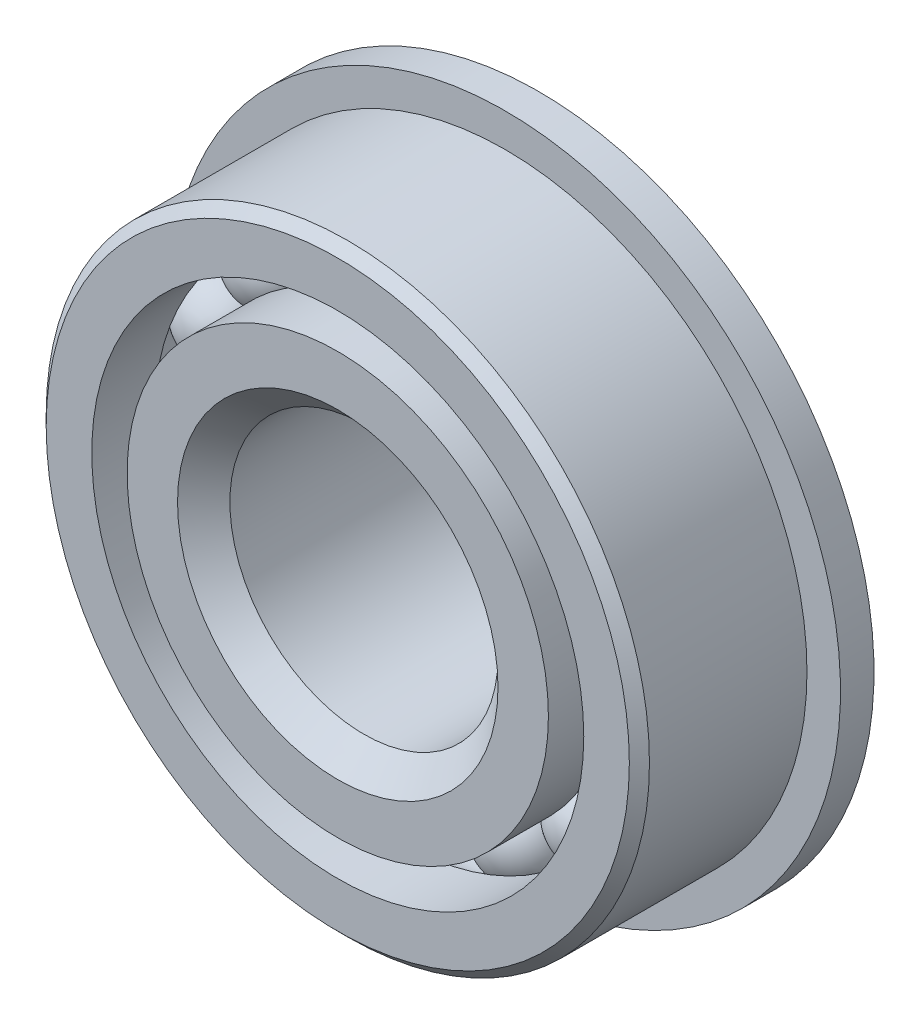
ISO-10303-21;
HEADER;
FILE_DESCRIPTION(('STEP AP214'),'2;1');
FILE_NAME('part.step','',(''),(''),'','','');
FILE_SCHEMA(('AUTOMOTIVE_DESIGN { 1 0 10303 214 1 1 1 1 }'));
ENDSEC;
DATA;
#1=APPLICATION_CONTEXT('core data for automotive mechanical design processes');
#2=APPLICATION_PROTOCOL_DEFINITION('international standard','automotive_design',2000,#1);
#3=PRODUCT_CONTEXT('',#1,'mechanical');
#4=PRODUCT('Part','Part','',(#3));
#5=PRODUCT_RELATED_PRODUCT_CATEGORY('part','',(#4));
#6=PRODUCT_DEFINITION_FORMATION('','',#4);
#7=PRODUCT_DEFINITION_CONTEXT('part definition',#1,'design');
#8=PRODUCT_DEFINITION('design','',#6,#7);
#9=PRODUCT_DEFINITION_SHAPE('','',#8);
#10=(LENGTH_UNIT() NAMED_UNIT(*) SI_UNIT(.MILLI.,.METRE.));
#11=(NAMED_UNIT(*) PLANE_ANGLE_UNIT() SI_UNIT($,.RADIAN.));
#12=(NAMED_UNIT(*) SI_UNIT($,.STERADIAN.) SOLID_ANGLE_UNIT());
#13=UNCERTAINTY_MEASURE_WITH_UNIT(LENGTH_MEASURE(1.E-05),#10,'distance_accuracy_value','');
#14=(GEOMETRIC_REPRESENTATION_CONTEXT(3) GLOBAL_UNCERTAINTY_ASSIGNED_CONTEXT((#13)) GLOBAL_UNIT_ASSIGNED_CONTEXT((#10,
#11,#12)) REPRESENTATION_CONTEXT('',''));
#15=CARTESIAN_POINT('',(0.,0.,0.));
#16=DIRECTION('',(0.,0.,1.));
#17=DIRECTION('',(1.,0.,0.));
#18=AXIS2_PLACEMENT_3D('',#15,#16,#17);
#19=CARTESIAN_POINT('',(-4.138661526742,9.99161278793267,0.));
#20=DIRECTION('',(0.,0.,1.));
#21=DIRECTION('',(-0.382683432365077,0.923879532511292,0.));
#22=AXIS2_PLACEMENT_3D('',#19,#20,#21);
#23=SPHERICAL_SURFACE('',#22,1.984375);
#24=CARTESIAN_POINT('',(-4.138661526742,9.99161278793267,1.984375));
#25=VERTEX_POINT('',#24);
#26=VERTEX_LOOP('',#25);
#27=FACE_BOUND('',#26,.T.);
#28=ADVANCED_FACE('F35',(#27),#23,.T.);
#29=CLOSED_SHELL('',(#28));
#30=MANIFOLD_SOLID_BREP('B2',#29);
#31=CARTESIAN_POINT('',(-7.64724935309786,7.64724935309804,0.));
#32=DIRECTION('',(0.,0.,1.));
#33=DIRECTION('',(-0.707106781186539,0.707106781186556,0.));
#34=AXIS2_PLACEMENT_3D('',#31,#32,#33);
#35=SPHERICAL_SURFACE('',#34,1.984375);
#36=CARTESIAN_POINT('',(-7.64724935309786,7.64724935309804,1.984375));
#37=VERTEX_POINT('',#36);
#38=VERTEX_LOOP('',#37);
#39=FACE_BOUND('',#38,.T.);
#40=ADVANCED_FACE('F53',(#39),#35,.T.);
#41=CLOSED_SHELL('',(#40));
#42=MANIFOLD_SOLID_BREP('B6',#41);
#43=CARTESIAN_POINT('',(-9.99161278793257,4.13866152674225,0.));
#44=DIRECTION('',(0.,0.,1.));
#45=DIRECTION('',(-0.923879532511283,0.3826834323651,0.));
#46=AXIS2_PLACEMENT_3D('',#43,#44,#45);
#47=SPHERICAL_SURFACE('',#46,1.984375);
#48=CARTESIAN_POINT('',(-9.99161278793257,4.13866152674225,1.984375));
#49=VERTEX_POINT('',#48);
#50=VERTEX_LOOP('',#49);
#51=FACE_BOUND('',#50,.T.);
#52=ADVANCED_FACE('F72',(#51),#47,.T.);
#53=CLOSED_SHELL('',(#52));
#54=MANIFOLD_SOLID_BREP('B31',#53);
#55=CARTESIAN_POINT('',(-10.81484375,1.13279541018368E-13,0.));
#56=DIRECTION('',(0.,0.,1.));
#57=DIRECTION('',(-1.,0.,0.));
#58=AXIS2_PLACEMENT_3D('',#55,#56,#57);
#59=SPHERICAL_SURFACE('',#58,1.984375);
#60=CARTESIAN_POINT('',(-10.81484375,1.13279541018368E-13,1.984375));
#61=VERTEX_POINT('',#60);
#62=VERTEX_LOOP('',#61);
#63=FACE_BOUND('',#62,.T.);
#64=ADVANCED_FACE('F93',(#63),#59,.T.);
#65=CLOSED_SHELL('',(#64));
#66=MANIFOLD_SOLID_BREP('B49',#65);
#67=CARTESIAN_POINT('',(-9.99161278793265,-4.13866152674204,0.));
#68=DIRECTION('',(0.,0.,1.));
#69=DIRECTION('',(-0.923879532511291,-0.382683432365081,0.));
#70=AXIS2_PLACEMENT_3D('',#67,#68,#69);
#71=SPHERICAL_SURFACE('',#70,1.984375);
#72=CARTESIAN_POINT('',(-9.99161278793265,-4.13866152674204,1.984375));
#73=VERTEX_POINT('',#72);
#74=VERTEX_LOOP('',#73);
#75=FACE_BOUND('',#74,.T.);
#76=ADVANCED_FACE('F111',(#75),#71,.T.);
#77=CLOSED_SHELL('',(#76));
#78=MANIFOLD_SOLID_BREP('B68',#77);
#79=CARTESIAN_POINT('',(-7.64724935309802,-7.64724935309789,0.));
#80=DIRECTION('',(0.,0.,1.));
#81=DIRECTION('',(-0.707106781186554,-0.707106781186541,0.));
#82=AXIS2_PLACEMENT_3D('',#79,#80,#81);
#83=SPHERICAL_SURFACE('',#82,1.984375);
#84=CARTESIAN_POINT('',(-7.64724935309802,-7.64724935309789,1.984375));
#85=VERTEX_POINT('',#84);
#86=VERTEX_LOOP('',#85);
#87=FACE_BOUND('',#86,.T.);
#88=ADVANCED_FACE('F129',(#87),#83,.T.);
#89=CLOSED_SHELL('',(#88));
#90=MANIFOLD_SOLID_BREP('B89',#89);
#91=CARTESIAN_POINT('',(-4.13866152674222,-9.99161278793258,0.));
#92=DIRECTION('',(0.,0.,1.));
#93=DIRECTION('',(-0.382683432365097,-0.923879532511284,0.));
#94=AXIS2_PLACEMENT_3D('',#91,#92,#93);
#95=SPHERICAL_SURFACE('',#94,1.984375);
#96=CARTESIAN_POINT('',(-4.13866152674222,-9.99161278793258,1.984375));
#97=VERTEX_POINT('',#96);
#98=VERTEX_LOOP('',#97);
#99=FACE_BOUND('',#98,.T.);
#100=ADVANCED_FACE('F147',(#99),#95,.T.);
#101=CLOSED_SHELL('',(#100));
#102=MANIFOLD_SOLID_BREP('B107',#101);
#103=CARTESIAN_POINT('',(0.,-10.81484375,0.));
#104=DIRECTION('',(0.,0.,1.));
#105=DIRECTION('',(0.,-1.,0.));
#106=AXIS2_PLACEMENT_3D('',#103,#104,#105);
#107=SPHERICAL_SURFACE('',#106,1.984375);
#108=CARTESIAN_POINT('',(0.,-10.81484375,1.984375));
#109=VERTEX_POINT('',#108);
#110=VERTEX_LOOP('',#109);
#111=FACE_BOUND('',#110,.T.);
#112=ADVANCED_FACE('F165',(#111),#107,.T.);
#113=CLOSED_SHELL('',(#112));
#114=MANIFOLD_SOLID_BREP('B125',#113);
#115=CARTESIAN_POINT('',(4.13866152674208,-9.99161278793264,0.));
#116=DIRECTION('',(0.,0.,1.));
#117=DIRECTION('',(0.382683432365084,-0.923879532511289,0.));
#118=AXIS2_PLACEMENT_3D('',#115,#116,#117);
#119=SPHERICAL_SURFACE('',#118,1.984375);
#120=CARTESIAN_POINT('',(4.13866152674208,-9.99161278793264,1.984375));
#121=VERTEX_POINT('',#120);
#122=VERTEX_LOOP('',#121);
#123=FACE_BOUND('',#122,.T.);
#124=ADVANCED_FACE('F183',(#123),#119,.T.);
#125=CLOSED_SHELL('',(#124));
#126=MANIFOLD_SOLID_BREP('B143',#125);
#127=CARTESIAN_POINT('',(7.64724935309791,-7.64724935309799,0.));
#128=DIRECTION('',(0.,0.,1.));
#129=DIRECTION('',(0.707106781186544,-0.707106781186551,0.));
#130=AXIS2_PLACEMENT_3D('',#127,#128,#129);
#131=SPHERICAL_SURFACE('',#130,1.984375);
#132=CARTESIAN_POINT('',(7.64724935309791,-7.64724935309799,1.984375));
#133=VERTEX_POINT('',#132);
#134=VERTEX_LOOP('',#133);
#135=FACE_BOUND('',#134,.T.);
#136=ADVANCED_FACE('F201',(#135),#131,.T.);
#137=CLOSED_SHELL('',(#136));
#138=MANIFOLD_SOLID_BREP('B161',#137);
#139=CARTESIAN_POINT('',(9.9916127879326,-4.13866152674218,0.));
#140=DIRECTION('',(0.,0.,1.));
#141=DIRECTION('',(0.923879532511285,-0.382683432365094,0.));
#142=AXIS2_PLACEMENT_3D('',#139,#140,#141);
#143=SPHERICAL_SURFACE('',#142,1.984375);
#144=CARTESIAN_POINT('',(9.9916127879326,-4.13866152674218,1.984375));
#145=VERTEX_POINT('',#144);
#146=VERTEX_LOOP('',#145);
#147=FACE_BOUND('',#146,.T.);
#148=ADVANCED_FACE('F219',(#147),#143,.T.);
#149=CLOSED_SHELL('',(#148));
#150=MANIFOLD_SOLID_BREP('B179',#149);
#151=CARTESIAN_POINT('',(10.81484375,0.,0.));
#152=DIRECTION('',(0.,0.,1.));
#153=DIRECTION('',(1.,0.,0.));
#154=AXIS2_PLACEMENT_3D('',#151,#152,#153);
#155=SPHERICAL_SURFACE('',#154,1.984375);
#156=CARTESIAN_POINT('',(10.81484375,0.,1.984375));
#157=VERTEX_POINT('',#156);
#158=VERTEX_LOOP('',#157);
#159=FACE_BOUND('',#158,.T.);
#160=ADVANCED_FACE('F238',(#159),#155,.T.);
#161=CLOSED_SHELL('',(#160));
#162=MANIFOLD_SOLID_BREP('B197',#161);
#163=CARTESIAN_POINT('',(9.99161278793262,4.13866152674211,0.));
#164=DIRECTION('',(0.,0.,1.));
#165=DIRECTION('',(0.923879532511288,0.382683432365087,0.));
#166=AXIS2_PLACEMENT_3D('',#163,#164,#165);
#167=SPHERICAL_SURFACE('',#166,1.984375);
#168=CARTESIAN_POINT('',(9.99161278793262,4.13866152674211,1.984375));
#169=VERTEX_POINT('',#168);
#170=VERTEX_LOOP('',#169);
#171=FACE_BOUND('',#170,.T.);
#172=ADVANCED_FACE('F259',(#171),#167,.T.);
#173=CLOSED_SHELL('',(#172));
#174=MANIFOLD_SOLID_BREP('B215',#173);
#175=CARTESIAN_POINT('',(7.64724935309796,7.64724935309794,0.));
#176=DIRECTION('',(0.,0.,1.));
#177=DIRECTION('',(0.707106781186549,0.707106781186546,0.));
#178=AXIS2_PLACEMENT_3D('',#175,#176,#177);
#179=SPHERICAL_SURFACE('',#178,1.984375);
#180=CARTESIAN_POINT('',(7.64724935309796,7.64724935309794,1.984375));
#181=VERTEX_POINT('',#180);
#182=VERTEX_LOOP('',#181);
#183=FACE_BOUND('',#182,.T.);
#184=ADVANCED_FACE('F277',(#183),#179,.T.);
#185=CLOSED_SHELL('',(#184));
#186=MANIFOLD_SOLID_BREP('B234',#185);
#187=CARTESIAN_POINT('',(4.13866152674215,9.99161278793261,0.));
#188=DIRECTION('',(0.,0.,1.));
#189=DIRECTION('',(0.382683432365091,0.923879532511287,0.));
#190=AXIS2_PLACEMENT_3D('',#187,#188,#189);
#191=SPHERICAL_SURFACE('',#190,1.984375);
#192=CARTESIAN_POINT('',(4.13866152674215,9.99161278793261,1.984375));
#193=VERTEX_POINT('',#192);
#194=VERTEX_LOOP('',#193);
#195=FACE_BOUND('',#194,.T.);
#196=ADVANCED_FACE('F295',(#195),#191,.T.);
#197=CLOSED_SHELL('',(#196));
#198=MANIFOLD_SOLID_BREP('B255',#197);
#199=CARTESIAN_POINT('',(0.,10.81484375,0.));
#200=DIRECTION('',(0.,0.,1.));
#201=DIRECTION('',(0.,1.,0.));
#202=AXIS2_PLACEMENT_3D('',#199,#200,#201);
#203=SPHERICAL_SURFACE('',#202,1.984375);
#204=CARTESIAN_POINT('',(0.,10.81484375,1.984375));
#205=VERTEX_POINT('',#204);
#206=VERTEX_LOOP('',#205);
#207=FACE_BOUND('',#206,.T.);
#208=ADVANCED_FACE('F316',(#207),#203,.T.);
#209=CLOSED_SHELL('',(#208));
#210=MANIFOLD_SOLID_BREP('B273',#209);
#211=CARTESIAN_POINT('',(0.,0.,4.7625));
#212=DIRECTION('',(0.,0.,1.));
#213=DIRECTION('',(1.,0.,0.));
#214=AXIS2_PLACEMENT_3D('',#211,#212,#213);
#215=CYLINDRICAL_SURFACE('',#214,9.97748111263737);
#216=CARTESIAN_POINT('',(0.,0.,-1.79904640133991));
#217=DIRECTION('',(0.,0.,1.));
#218=DIRECTION('',(1.,0.,0.));
#219=AXIS2_PLACEMENT_3D('',#216,#217,#218);
#220=CIRCLE('',#219,9.97748111263737);
#221=CARTESIAN_POINT('',(9.97748111263737,0.,-1.79904640133991));
#222=VERTEX_POINT('',#221);
#223=EDGE_CURVE('E350',#222,#222,#220,.T.);
#224=ORIENTED_EDGE('',*,*,#223,.F.);
#225=EDGE_LOOP('',(#224));
#226=FACE_BOUND('',#225,.T.);
#227=CARTESIAN_POINT('',(0.,0.,-6.35));
#228=DIRECTION('',(0.,0.,1.));
#229=DIRECTION('',(1.,0.,0.));
#230=AXIS2_PLACEMENT_3D('',#227,#228,#229);
#231=CIRCLE('',#230,9.97748111263737);
#232=CARTESIAN_POINT('',(9.97748111263737,0.,-6.35));
#233=VERTEX_POINT('',#232);
#234=EDGE_CURVE('E354',#233,#233,#231,.T.);
#235=ORIENTED_EDGE('',*,*,#234,.T.);
#236=EDGE_LOOP('',(#235));
#237=FACE_BOUND('',#236,.T.);
#238=ADVANCED_FACE('F339',(#226,#237),#215,.T.);
#239=CARTESIAN_POINT('',(0.,6.82625,-6.35));
#240=DIRECTION('',(0.,0.,1.));
#241=DIRECTION('',(1.,0.,0.));
#242=AXIS2_PLACEMENT_3D('',#239,#240,#241);
#243=PLANE('',#242);
#244=ORIENTED_EDGE('',*,*,#234,.F.);
#245=EDGE_LOOP('',(#244));
#246=FACE_BOUND('',#245,.T.);
#247=CARTESIAN_POINT('',(0.,0.,-6.35));
#248=DIRECTION('',(0.,0.,1.));
#249=DIRECTION('',(1.,0.,0.));
#250=AXIS2_PLACEMENT_3D('',#247,#248,#249);
#251=CIRCLE('',#250,6.82625);
#252=CARTESIAN_POINT('',(6.82625,0.,-6.35));
#253=VERTEX_POINT('',#252);
#254=EDGE_CURVE('E359',#253,#253,#251,.T.);
#255=ORIENTED_EDGE('',*,*,#254,.T.);
#256=EDGE_LOOP('',(#255));
#257=FACE_BOUND('',#256,.T.);
#258=ADVANCED_FACE('F386',(#246,#257),#243,.F.);
#259=CARTESIAN_POINT('',(0.,0.,-5.87375));
#260=DIRECTION('',(0.,0.,-1.));
#261=DIRECTION('',(-1.,0.,0.));
#262=AXIS2_PLACEMENT_3D('',#259,#260,#261);
#263=CONICAL_SURFACE('',#262,6.35,0.785398163397445);
#264=ORIENTED_EDGE('',*,*,#254,.F.);
#265=EDGE_LOOP('',(#264));
#266=FACE_BOUND('',#265,.T.);
#267=CARTESIAN_POINT('',(0.,0.,-5.87375));
#268=DIRECTION('',(0.,0.,1.));
#269=DIRECTION('',(1.,0.,0.));
#270=AXIS2_PLACEMENT_3D('',#267,#268,#269);
#271=CIRCLE('',#270,6.35);
#272=CARTESIAN_POINT('',(6.35,0.,-5.87375));
#273=VERTEX_POINT('',#272);
#274=EDGE_CURVE('E362',#273,#273,#271,.T.);
#275=ORIENTED_EDGE('',*,*,#274,.T.);
#276=EDGE_LOOP('',(#275));
#277=FACE_BOUND('',#276,.T.);
#278=ADVANCED_FACE('F392',(#266,#277),#263,.F.);
#279=CARTESIAN_POINT('',(0.,0.,4.7625));
#280=DIRECTION('',(0.,0.,1.));
#281=DIRECTION('',(1.,0.,0.));
#282=AXIS2_PLACEMENT_3D('',#279,#280,#281);
#283=CYLINDRICAL_SURFACE('',#282,6.35);
#284=ORIENTED_EDGE('',*,*,#274,.F.);
#285=EDGE_LOOP('',(#284));
#286=FACE_BOUND('',#285,.T.);
#287=CARTESIAN_POINT('',(0.,0.,3.52226562500001));
#288=DIRECTION('',(0.,0.,1.));
#289=DIRECTION('',(1.,0.,0.));
#290=AXIS2_PLACEMENT_3D('',#287,#288,#289);
#291=CIRCLE('',#290,6.35);
#292=CARTESIAN_POINT('',(6.35,0.,3.52226562500001));
#293=VERTEX_POINT('',#292);
#294=EDGE_CURVE('E365',#293,#293,#291,.T.);
#295=ORIENTED_EDGE('',*,*,#294,.T.);
#296=EDGE_LOOP('',(#295));
#297=FACE_BOUND('',#296,.T.);
#298=ADVANCED_FACE('F382',(#286,#297),#283,.F.);
#299=CARTESIAN_POINT('',(0.,0.,4.7625));
#300=DIRECTION('',(0.,0.,1.));
#301=DIRECTION('',(1.,0.,0.));
#302=AXIS2_PLACEMENT_3D('',#299,#300,#301);
#303=CONICAL_SURFACE('',#302,7.590234375,0.78539816339745);
#304=ORIENTED_EDGE('',*,*,#294,.F.);
#305=EDGE_LOOP('',(#304));
#306=FACE_BOUND('',#305,.T.);
#307=CARTESIAN_POINT('',(0.,0.,4.7625));
#308=DIRECTION('',(0.,0.,1.));
#309=DIRECTION('',(1.,0.,0.));
#310=AXIS2_PLACEMENT_3D('',#307,#308,#309);
#311=CIRCLE('',#310,7.590234375);
#312=CARTESIAN_POINT('',(7.590234375,0.,4.7625));
#313=VERTEX_POINT('',#312);
#314=EDGE_CURVE('E368',#313,#313,#311,.T.);
#315=ORIENTED_EDGE('',*,*,#314,.T.);
#316=EDGE_LOOP('',(#315));
#317=FACE_BOUND('',#316,.T.);
#318=ADVANCED_FACE('F372',(#306,#317),#303,.F.);
#319=CARTESIAN_POINT('',(0.,9.97748111263737,4.7625));
#320=DIRECTION('',(0.,0.,-1.));
#321=DIRECTION('',(-1.,0.,0.));
#322=AXIS2_PLACEMENT_3D('',#319,#320,#321);
#323=PLANE('',#322);
#324=CARTESIAN_POINT('',(0.,0.,4.7625));
#325=DIRECTION('',(0.,0.,1.));
#326=DIRECTION('',(1.,0.,0.));
#327=AXIS2_PLACEMENT_3D('',#324,#325,#326);
#328=CIRCLE('',#327,9.97748111263737);
#329=CARTESIAN_POINT('',(9.97748111263737,0.,4.7625));
#330=VERTEX_POINT('',#329);
#331=EDGE_CURVE('E346',#330,#330,#328,.T.);
#332=ORIENTED_EDGE('',*,*,#331,.T.);
#333=EDGE_LOOP('',(#332));
#334=FACE_BOUND('',#333,.T.);
#335=ORIENTED_EDGE('',*,*,#314,.F.);
#336=EDGE_LOOP('',(#335));
#337=FACE_BOUND('',#336,.T.);
#338=ADVANCED_FACE('F341',(#334,#337),#323,.F.);
#339=CARTESIAN_POINT('',(0.,0.,0.));
#340=DIRECTION('',(0.,0.,1.));
#341=DIRECTION('',(1.,0.,0.));
#342=AXIS2_PLACEMENT_3D('',#339,#340,#341);
#343=TOROIDAL_SURFACE('',#342,10.81484375,1.984375);
#344=CARTESIAN_POINT('',(0.,0.,1.79904640133991));
#345=DIRECTION('',(0.,0.,1.));
#346=DIRECTION('',(1.,0.,0.));
#347=AXIS2_PLACEMENT_3D('',#344,#345,#346);
#348=CIRCLE('',#347,9.97748111263737);
#349=CARTESIAN_POINT('',(9.97748111263737,0.,1.79904640133991));
#350=VERTEX_POINT('',#349);
#351=EDGE_CURVE('E315',#350,#350,#348,.T.);
#352=ORIENTED_EDGE('',*,*,#351,.F.);
#353=EDGE_LOOP('',(#352));
#354=FACE_BOUND('',#353,.T.);
#355=ORIENTED_EDGE('',*,*,#223,.T.);
#356=EDGE_LOOP('',(#355));
#357=FACE_BOUND('',#356,.T.);
#358=ADVANCED_FACE('F375',(#354,#357),#343,.F.);
#359=CARTESIAN_POINT('',(0.,0.,4.7625));
#360=DIRECTION('',(0.,0.,1.));
#361=DIRECTION('',(1.,0.,0.));
#362=AXIS2_PLACEMENT_3D('',#359,#360,#361);
#363=CYLINDRICAL_SURFACE('',#362,9.97748111263737);
#364=ORIENTED_EDGE('',*,*,#331,.F.);
#365=EDGE_LOOP('',(#364));
#366=FACE_BOUND('',#365,.T.);
#367=ORIENTED_EDGE('',*,*,#351,.T.);
#368=EDGE_LOOP('',(#367));
#369=FACE_BOUND('',#368,.T.);
#370=ADVANCED_FACE('F380',(#366,#369),#363,.T.);
#371=CLOSED_SHELL('',(#238,#258,#278,#298,#318,#338,#358,#370));
#372=MANIFOLD_SOLID_BREP('B291',#371);
#373=CARTESIAN_POINT('',(0.,0.,4.28625));
#374=DIRECTION('',(0.,0.,-1.));
#375=DIRECTION('',(-1.,0.,0.));
#376=AXIS2_PLACEMENT_3D('',#373,#374,#375);
#377=CONICAL_SURFACE('',#376,14.2875,0.78539816339745);
#378=CARTESIAN_POINT('',(0.,0.,4.7625));
#379=DIRECTION('',(0.,0.,1.));
#380=DIRECTION('',(1.,0.,0.));
#381=AXIS2_PLACEMENT_3D('',#378,#379,#380);
#382=CIRCLE('',#381,13.81125);
#383=CARTESIAN_POINT('',(13.81125,0.,4.7625));
#384=VERTEX_POINT('',#383);
#385=EDGE_CURVE('E491',#384,#384,#382,.T.);
#386=ORIENTED_EDGE('',*,*,#385,.F.);
#387=EDGE_LOOP('',(#386));
#388=FACE_BOUND('',#387,.T.);
#389=CARTESIAN_POINT('',(0.,0.,4.28625));
#390=DIRECTION('',(0.,0.,1.));
#391=DIRECTION('',(1.,0.,0.));
#392=AXIS2_PLACEMENT_3D('',#389,#390,#391);
#393=CIRCLE('',#392,14.2875);
#394=CARTESIAN_POINT('',(14.2875,0.,4.28625));
#395=VERTEX_POINT('',#394);
#396=EDGE_CURVE('E338',#395,#395,#393,.T.);
#397=ORIENTED_EDGE('',*,*,#396,.T.);
#398=EDGE_LOOP('',(#397));
#399=FACE_BOUND('',#398,.T.);
#400=ADVANCED_FACE('F469',(#388,#399),#377,.T.);
#401=CARTESIAN_POINT('',(0.,0.,4.7625));
#402=DIRECTION('',(0.,0.,1.));
#403=DIRECTION('',(1.,0.,0.));
#404=AXIS2_PLACEMENT_3D('',#401,#402,#403);
#405=CYLINDRICAL_SURFACE('',#404,14.2875);
#406=CARTESIAN_POINT('',(0.,0.,-3.175));
#407=DIRECTION('',(0.,0.,1.));
#408=DIRECTION('',(1.,0.,0.));
#409=AXIS2_PLACEMENT_3D('',#406,#407,#408);
#410=CIRCLE('',#409,14.2875);
#411=CARTESIAN_POINT('',(14.2875,0.,-3.175));
#412=VERTEX_POINT('',#411);
#413=EDGE_CURVE('E472',#412,#412,#410,.T.);
#414=ORIENTED_EDGE('',*,*,#413,.T.);
#415=EDGE_LOOP('',(#414));
#416=FACE_BOUND('',#415,.T.);
#417=ORIENTED_EDGE('',*,*,#396,.F.);
#418=EDGE_LOOP('',(#417));
#419=FACE_BOUND('',#418,.T.);
#420=ADVANCED_FACE('F512',(#416,#419),#405,.T.);
#421=CARTESIAN_POINT('',(0.,13.81125,-4.7625));
#422=DIRECTION('',(0.,0.,1.));
#423=DIRECTION('',(1.,0.,0.));
#424=AXIS2_PLACEMENT_3D('',#421,#422,#423);
#425=PLANE('',#424);
#426=CARTESIAN_POINT('',(0.,0.,-4.7625));
#427=DIRECTION('',(0.,0.,1.));
#428=DIRECTION('',(1.,0.,0.));
#429=AXIS2_PLACEMENT_3D('',#426,#427,#428);
#430=CIRCLE('',#429,11.6522063873626);
#431=CARTESIAN_POINT('',(11.6522063873626,0.,-4.7625));
#432=VERTEX_POINT('',#431);
#433=EDGE_CURVE('E476',#432,#432,#430,.T.);
#434=ORIENTED_EDGE('',*,*,#433,.T.);
#435=EDGE_LOOP('',(#434));
#436=FACE_BOUND('',#435,.T.);
#437=CARTESIAN_POINT('',(0.,0.,-4.7625));
#438=DIRECTION('',(0.,0.,-1.));
#439=DIRECTION('',(-1.,0.,0.));
#440=AXIS2_PLACEMENT_3D('',#437,#438,#439);
#441=CIRCLE('',#440,15.875);
#442=CARTESIAN_POINT('',(-15.875,0.,-4.7625));
#443=VERTEX_POINT('',#442);
#444=EDGE_CURVE('E494',#443,#443,#441,.T.);
#445=ORIENTED_EDGE('',*,*,#444,.T.);
#446=EDGE_LOOP('',(#445));
#447=FACE_BOUND('',#446,.T.);
#448=ADVANCED_FACE('F515',(#436,#447),#425,.F.);
#449=CARTESIAN_POINT('',(0.,0.,4.7625));
#450=DIRECTION('',(0.,0.,1.));
#451=DIRECTION('',(1.,0.,0.));
#452=AXIS2_PLACEMENT_3D('',#449,#450,#451);
#453=CYLINDRICAL_SURFACE('',#452,11.6522063873626);
#454=ORIENTED_EDGE('',*,*,#433,.F.);
#455=EDGE_LOOP('',(#454));
#456=FACE_BOUND('',#455,.T.);
#457=CARTESIAN_POINT('',(0.,0.,-1.79904640133991));
#458=DIRECTION('',(0.,0.,1.));
#459=DIRECTION('',(1.,0.,0.));
#460=AXIS2_PLACEMENT_3D('',#457,#458,#459);
#461=CIRCLE('',#460,11.6522063873626);
#462=CARTESIAN_POINT('',(11.6522063873626,0.,-1.79904640133991));
#463=VERTEX_POINT('',#462);
#464=EDGE_CURVE('E480',#463,#463,#461,.T.);
#465=ORIENTED_EDGE('',*,*,#464,.T.);
#466=EDGE_LOOP('',(#465));
#467=FACE_BOUND('',#466,.T.);
#468=ADVANCED_FACE('F520',(#456,#467),#453,.F.);
#469=CARTESIAN_POINT('',(0.,0.,0.));
#470=DIRECTION('',(0.,0.,1.));
#471=DIRECTION('',(1.,0.,0.));
#472=AXIS2_PLACEMENT_3D('',#469,#470,#471);
#473=TOROIDAL_SURFACE('',#472,10.81484375,1.984375);
#474=ORIENTED_EDGE('',*,*,#464,.F.);
#475=EDGE_LOOP('',(#474));
#476=FACE_BOUND('',#475,.T.);
#477=CARTESIAN_POINT('',(0.,0.,1.79904640133991));
#478=DIRECTION('',(0.,0.,1.));
#479=DIRECTION('',(1.,0.,0.));
#480=AXIS2_PLACEMENT_3D('',#477,#478,#479);
#481=CIRCLE('',#480,11.6522063873626);
#482=CARTESIAN_POINT('',(11.6522063873626,0.,1.79904640133991));
#483=VERTEX_POINT('',#482);
#484=EDGE_CURVE('E485',#483,#483,#481,.T.);
#485=ORIENTED_EDGE('',*,*,#484,.T.);
#486=EDGE_LOOP('',(#485));
#487=FACE_BOUND('',#486,.T.);
#488=ADVANCED_FACE('F527',(#476,#487),#473,.F.);
#489=CARTESIAN_POINT('',(0.,0.,4.7625));
#490=DIRECTION('',(0.,0.,1.));
#491=DIRECTION('',(1.,0.,0.));
#492=AXIS2_PLACEMENT_3D('',#489,#490,#491);
#493=CYLINDRICAL_SURFACE('',#492,11.6522063873626);
#494=ORIENTED_EDGE('',*,*,#484,.F.);
#495=EDGE_LOOP('',(#494));
#496=FACE_BOUND('',#495,.T.);
#497=CARTESIAN_POINT('',(0.,0.,4.7625));
#498=DIRECTION('',(0.,0.,1.));
#499=DIRECTION('',(1.,0.,0.));
#500=AXIS2_PLACEMENT_3D('',#497,#498,#499);
#501=CIRCLE('',#500,11.6522063873626);
#502=CARTESIAN_POINT('',(11.6522063873626,0.,4.7625));
#503=VERTEX_POINT('',#502);
#504=EDGE_CURVE('E488',#503,#503,#501,.T.);
#505=ORIENTED_EDGE('',*,*,#504,.T.);
#506=EDGE_LOOP('',(#505));
#507=FACE_BOUND('',#506,.T.);
#508=ADVANCED_FACE('F531',(#496,#507),#493,.F.);
#509=CARTESIAN_POINT('',(0.,13.81125,4.7625));
#510=DIRECTION('',(0.,0.,-1.));
#511=DIRECTION('',(-1.,0.,0.));
#512=AXIS2_PLACEMENT_3D('',#509,#510,#511);
#513=PLANE('',#512);
#514=ORIENTED_EDGE('',*,*,#504,.F.);
#515=EDGE_LOOP('',(#514));
#516=FACE_BOUND('',#515,.T.);
#517=ORIENTED_EDGE('',*,*,#385,.T.);
#518=EDGE_LOOP('',(#517));
#519=FACE_BOUND('',#518,.T.);
#520=ADVANCED_FACE('F507',(#516,#519),#513,.F.);
#521=CARTESIAN_POINT('',(0.,12.7317281936813,-3.175));
#522=DIRECTION('',(0.,0.,1.));
#523=DIRECTION('',(1.,0.,0.));
#524=AXIS2_PLACEMENT_3D('',#521,#522,#523);
#525=PLANE('',#524);
#526=CARTESIAN_POINT('',(0.,0.,-3.175));
#527=DIRECTION('',(0.,0.,-1.));
#528=DIRECTION('',(-1.,0.,0.));
#529=AXIS2_PLACEMENT_3D('',#526,#527,#528);
#530=CIRCLE('',#529,15.875);
#531=CARTESIAN_POINT('',(-15.875,0.,-3.175));
#532=VERTEX_POINT('',#531);
#533=EDGE_CURVE('E497',#532,#532,#530,.T.);
#534=ORIENTED_EDGE('',*,*,#533,.F.);
#535=EDGE_LOOP('',(#534));
#536=FACE_BOUND('',#535,.T.);
#537=ORIENTED_EDGE('',*,*,#413,.F.);
#538=EDGE_LOOP('',(#537));
#539=FACE_BOUND('',#538,.T.);
#540=ADVANCED_FACE('F504',(#536,#539),#525,.T.);
#541=CARTESIAN_POINT('',(0.,0.,-6.35));
#542=DIRECTION('',(0.,0.,-1.));
#543=DIRECTION('',(-1.,0.,0.));
#544=AXIS2_PLACEMENT_3D('',#541,#542,#543);
#545=CYLINDRICAL_SURFACE('',#544,15.875);
#546=ORIENTED_EDGE('',*,*,#533,.T.);
#547=EDGE_LOOP('',(#546));
#548=FACE_BOUND('',#547,.T.);
#549=ORIENTED_EDGE('',*,*,#444,.F.);
#550=EDGE_LOOP('',(#549));
#551=FACE_BOUND('',#550,.T.);
#552=ADVANCED_FACE('F501',(#548,#551),#545,.T.);
#553=CLOSED_SHELL('',(#400,#420,#448,#468,#488,#508,#520,#540,#552));
#554=MANIFOLD_SOLID_BREP('B310',#553);
#555=ADVANCED_BREP_SHAPE_REPRESENTATION('',(#18,#30,#42,#54,#66,#78,#90,#102,#114,#126,#138,
#150,#162,#174,#186,#198,#210,#372,#554),#14);
#556=SHAPE_DEFINITION_REPRESENTATION(#9,#555);
ENDSEC;
END-ISO-10303-21;
